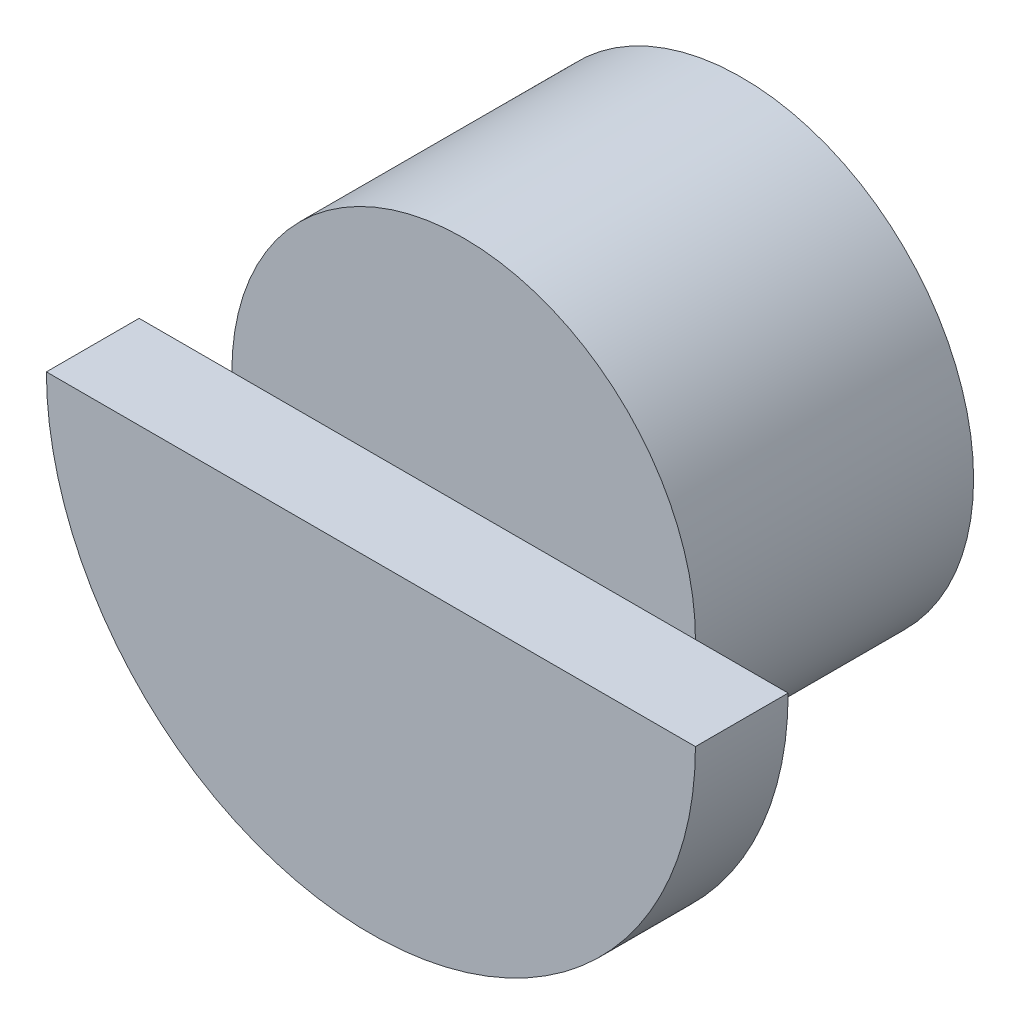
ISO-10303-21;
HEADER;
FILE_DESCRIPTION(('STEP AP214'),'2;1');
FILE_NAME('part.step','',(''),(''),'','','');
FILE_SCHEMA(('AUTOMOTIVE_DESIGN { 1 0 10303 214 1 1 1 1 }'));
ENDSEC;
DATA;
#1=APPLICATION_CONTEXT('core data for automotive mechanical design processes');
#2=APPLICATION_PROTOCOL_DEFINITION('international standard','automotive_design',2000,#1);
#3=PRODUCT_CONTEXT('',#1,'mechanical');
#4=PRODUCT('Part','Part','',(#3));
#5=PRODUCT_RELATED_PRODUCT_CATEGORY('part','',(#4));
#6=PRODUCT_DEFINITION_FORMATION('','',#4);
#7=PRODUCT_DEFINITION_CONTEXT('part definition',#1,'design');
#8=PRODUCT_DEFINITION('design','',#6,#7);
#9=PRODUCT_DEFINITION_SHAPE('','',#8);
#10=(LENGTH_UNIT() NAMED_UNIT(*) SI_UNIT(.MILLI.,.METRE.));
#11=(NAMED_UNIT(*) PLANE_ANGLE_UNIT() SI_UNIT($,.RADIAN.));
#12=(NAMED_UNIT(*) SI_UNIT($,.STERADIAN.) SOLID_ANGLE_UNIT());
#13=UNCERTAINTY_MEASURE_WITH_UNIT(LENGTH_MEASURE(1.E-05),#10,'distance_accuracy_value','');
#14=(GEOMETRIC_REPRESENTATION_CONTEXT(3) GLOBAL_UNCERTAINTY_ASSIGNED_CONTEXT((#13)) GLOBAL_UNIT_ASSIGNED_CONTEXT((#10,
#11,#12)) REPRESENTATION_CONTEXT('',''));
#15=CARTESIAN_POINT('',(0.,0.,0.));
#16=DIRECTION('',(0.,0.,1.));
#17=DIRECTION('',(1.,0.,0.));
#18=AXIS2_PLACEMENT_3D('',#15,#16,#17);
#19=CARTESIAN_POINT('',(0.,0.,30.));
#20=DIRECTION('',(0.,0.,-1.));
#21=DIRECTION('',(-1.,0.,0.));
#22=AXIS2_PLACEMENT_3D('',#19,#20,#21);
#23=CYLINDRICAL_SURFACE('',#22,25.);
#24=CARTESIAN_POINT('',(0.,0.,30.));
#25=DIRECTION('',(0.,0.,1.));
#26=DIRECTION('',(1.,0.,0.));
#27=AXIS2_PLACEMENT_3D('',#24,#25,#26);
#28=CIRCLE('',#27,25.);
#29=CARTESIAN_POINT('',(25.,0.,30.));
#30=VERTEX_POINT('',#29);
#31=CARTESIAN_POINT('',(-25.,0.,30.));
#32=VERTEX_POINT('',#31);
#33=EDGE_CURVE('E56',#30,#32,#28,.T.);
#34=ORIENTED_EDGE('',*,*,#33,.F.);
#35=EDGE_CURVE('E107',#32,#30,#28,.T.);
#36=ORIENTED_EDGE('',*,*,#35,.F.);
#37=EDGE_LOOP('',(#34,#36));
#38=FACE_BOUND('',#37,.T.);
#39=CARTESIAN_POINT('',(0.,0.,0.));
#40=DIRECTION('',(0.,0.,1.));
#41=DIRECTION('',(1.,0.,0.));
#42=AXIS2_PLACEMENT_3D('',#39,#40,#41);
#43=CIRCLE('',#42,25.);
#44=CARTESIAN_POINT('',(25.,0.,0.));
#45=VERTEX_POINT('',#44);
#46=EDGE_CURVE('E50',#45,#45,#43,.T.);
#47=ORIENTED_EDGE('',*,*,#46,.T.);
#48=EDGE_LOOP('',(#47));
#49=FACE_BOUND('',#48,.T.);
#50=ADVANCED_FACE('F47',(#38,#49),#23,.T.);
#51=CARTESIAN_POINT('',(0.,0.,30.));
#52=DIRECTION('',(0.,0.,1.));
#53=DIRECTION('',(1.,0.,0.));
#54=AXIS2_PLACEMENT_3D('',#51,#52,#53);
#55=PLANE('',#54);
#56=DIRECTION('',(-1.,0.,0.));
#57=VECTOR('',#56,1.);
#58=CARTESIAN_POINT('',(-35.,0.,30.));
#59=LINE('',#58,#57);
#60=EDGE_CURVE('E11',#30,#32,#59,.T.);
#61=ORIENTED_EDGE('',*,*,#60,.F.);
#62=ORIENTED_EDGE('',*,*,#33,.T.);
#63=EDGE_LOOP('',(#61,#62));
#64=FACE_BOUND('',#63,.T.);
#65=ADVANCED_FACE('F122',(#64),#55,.T.);
#66=CARTESIAN_POINT('',(0.,0.,0.));
#67=DIRECTION('',(0.,0.,1.));
#68=DIRECTION('',(1.,0.,0.));
#69=AXIS2_PLACEMENT_3D('',#66,#67,#68);
#70=PLANE('',#69);
#71=ORIENTED_EDGE('',*,*,#46,.F.);
#72=EDGE_LOOP('',(#71));
#73=FACE_BOUND('',#72,.T.);
#74=ADVANCED_FACE('F125',(#73),#70,.F.);
#75=CARTESIAN_POINT('',(0.,0.,30.));
#76=DIRECTION('',(0.,0.,1.));
#77=DIRECTION('',(1.,0.,0.));
#78=AXIS2_PLACEMENT_3D('',#75,#76,#77);
#79=PLANE('',#78);
#80=CARTESIAN_POINT('',(-35.,0.,30.));
#81=VERTEX_POINT('',#80);
#82=EDGE_CURVE('E59',#32,#81,#59,.T.);
#83=ORIENTED_EDGE('',*,*,#82,.F.);
#84=ORIENTED_EDGE('',*,*,#35,.T.);
#85=CARTESIAN_POINT('',(35.,0.,30.));
#86=VERTEX_POINT('',#85);
#87=EDGE_CURVE('E58',#86,#30,#59,.T.);
#88=ORIENTED_EDGE('',*,*,#87,.F.);
#89=CARTESIAN_POINT('',(0.,0.,30.));
#90=DIRECTION('',(0.,0.,1.));
#91=DIRECTION('',(1.,0.,0.));
#92=AXIS2_PLACEMENT_3D('',#89,#90,#91);
#93=CIRCLE('',#92,35.);
#94=EDGE_CURVE('E101',#81,#86,#93,.T.);
#95=ORIENTED_EDGE('',*,*,#94,.F.);
#96=EDGE_LOOP('',(#83,#84,#88,#95));
#97=FACE_BOUND('',#96,.T.);
#98=ADVANCED_FACE('F114',(#97),#79,.F.);
#99=CARTESIAN_POINT('',(0.,0.,40.));
#100=DIRECTION('',(0.,0.,-1.));
#101=DIRECTION('',(-1.,0.,0.));
#102=AXIS2_PLACEMENT_3D('',#99,#100,#101);
#103=CYLINDRICAL_SURFACE('',#102,35.);
#104=ORIENTED_EDGE('',*,*,#94,.T.);
#105=DIRECTION('',(0.,0.,-1.));
#106=VECTOR('',#105,1.);
#107=CARTESIAN_POINT('',(35.,0.,40.));
#108=LINE('',#107,#106);
#109=CARTESIAN_POINT('',(35.,0.,40.));
#110=VERTEX_POINT('',#109);
#111=EDGE_CURVE('E86',#110,#86,#108,.T.);
#112=ORIENTED_EDGE('',*,*,#111,.F.);
#113=CARTESIAN_POINT('',(0.,0.,40.));
#114=DIRECTION('',(0.,0.,1.));
#115=DIRECTION('',(1.,0.,0.));
#116=AXIS2_PLACEMENT_3D('',#113,#114,#115);
#117=CIRCLE('',#116,35.);
#118=CARTESIAN_POINT('',(-35.,0.,40.));
#119=VERTEX_POINT('',#118);
#120=EDGE_CURVE('E93',#119,#110,#117,.T.);
#121=ORIENTED_EDGE('',*,*,#120,.F.);
#122=DIRECTION('',(0.,0.,-1.));
#123=VECTOR('',#122,1.);
#124=CARTESIAN_POINT('',(-35.,0.,40.));
#125=LINE('',#124,#123);
#126=EDGE_CURVE('E89',#119,#81,#125,.T.);
#127=ORIENTED_EDGE('',*,*,#126,.T.);
#128=EDGE_LOOP('',(#104,#112,#121,#127));
#129=FACE_BOUND('',#128,.T.);
#130=ADVANCED_FACE('F99',(#129),#103,.T.);
#131=CARTESIAN_POINT('',(-35.,0.,40.));
#132=DIRECTION('',(0.,-1.,0.));
#133=DIRECTION('',(0.,0.,-1.));
#134=AXIS2_PLACEMENT_3D('',#131,#132,#133);
#135=PLANE('',#134);
#136=ORIENTED_EDGE('',*,*,#87,.T.);
#137=ORIENTED_EDGE('',*,*,#60,.T.);
#138=ORIENTED_EDGE('',*,*,#82,.T.);
#139=ORIENTED_EDGE('',*,*,#126,.F.);
#140=DIRECTION('',(-1.,0.,0.));
#141=VECTOR('',#140,1.);
#142=CARTESIAN_POINT('',(-35.,0.,40.));
#143=LINE('',#142,#141);
#144=EDGE_CURVE('E81',#110,#119,#143,.T.);
#145=ORIENTED_EDGE('',*,*,#144,.F.);
#146=ORIENTED_EDGE('',*,*,#111,.T.);
#147=EDGE_LOOP('',(#136,#137,#138,#139,#145,#146));
#148=FACE_BOUND('',#147,.T.);
#149=ADVANCED_FACE('F84',(#148),#135,.F.);
#150=CARTESIAN_POINT('',(0.,0.,40.));
#151=DIRECTION('',(0.,0.,1.));
#152=DIRECTION('',(1.,0.,0.));
#153=AXIS2_PLACEMENT_3D('',#150,#151,#152);
#154=PLANE('',#153);
#155=ORIENTED_EDGE('',*,*,#120,.T.);
#156=ORIENTED_EDGE('',*,*,#144,.T.);
#157=EDGE_LOOP('',(#155,#156));
#158=FACE_BOUND('',#157,.T.);
#159=ADVANCED_FACE('F95',(#158),#154,.T.);
#160=CLOSED_SHELL('',(#50,#65,#74,#98,#130,#149,#159));
#161=MANIFOLD_SOLID_BREP('B2',#160);
#162=ADVANCED_BREP_SHAPE_REPRESENTATION('',(#18,#161),#14);
#163=SHAPE_DEFINITION_REPRESENTATION(#9,#162);
ENDSEC;
END-ISO-10303-21;
